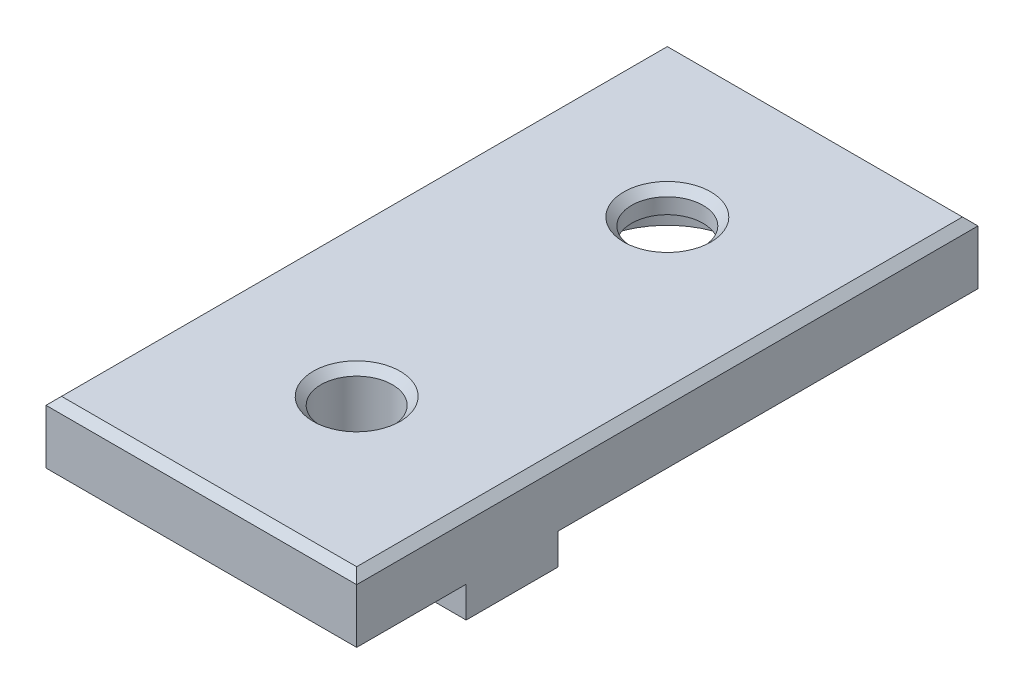
ISO-10303-21;
HEADER;
FILE_DESCRIPTION(('STEP AP214'),'2;1');
FILE_NAME('part.step','',(''),(''),'','','');
FILE_SCHEMA(('AUTOMOTIVE_DESIGN { 1 0 10303 214 1 1 1 1 }'));
ENDSEC;
DATA;
#1=APPLICATION_CONTEXT('core data for automotive mechanical design processes');
#2=APPLICATION_PROTOCOL_DEFINITION('international standard','automotive_design',2000,#1);
#3=PRODUCT_CONTEXT('',#1,'mechanical');
#4=PRODUCT('Part','Part','',(#3));
#5=PRODUCT_RELATED_PRODUCT_CATEGORY('part','',(#4));
#6=PRODUCT_DEFINITION_FORMATION('','',#4);
#7=PRODUCT_DEFINITION_CONTEXT('part definition',#1,'design');
#8=PRODUCT_DEFINITION('design','',#6,#7);
#9=PRODUCT_DEFINITION_SHAPE('','',#8);
#10=(LENGTH_UNIT() NAMED_UNIT(*) SI_UNIT(.MILLI.,.METRE.));
#11=(NAMED_UNIT(*) PLANE_ANGLE_UNIT() SI_UNIT($,.RADIAN.));
#12=(NAMED_UNIT(*) SI_UNIT($,.STERADIAN.) SOLID_ANGLE_UNIT());
#13=UNCERTAINTY_MEASURE_WITH_UNIT(LENGTH_MEASURE(1.E-05),#10,'distance_accuracy_value','');
#14=(GEOMETRIC_REPRESENTATION_CONTEXT(3) GLOBAL_UNCERTAINTY_ASSIGNED_CONTEXT((#13)) GLOBAL_UNIT_ASSIGNED_CONTEXT((#10,
#11,#12)) REPRESENTATION_CONTEXT('',''));
#15=CARTESIAN_POINT('',(0.,0.,0.));
#16=DIRECTION('',(0.,0.,1.));
#17=DIRECTION('',(1.,0.,0.));
#18=AXIS2_PLACEMENT_3D('',#15,#16,#17);
#19=CARTESIAN_POINT('',(0.,0.,-10.));
#20=DIRECTION('',(0.,1.,0.));
#21=DIRECTION('',(0.,0.,1.));
#22=AXIS2_PLACEMENT_3D('',#19,#20,#21);
#23=CYLINDRICAL_SURFACE('',#22,2.3);
#24=CARTESIAN_POINT('',(0.,3.5,-10.));
#25=DIRECTION('',(0.,1.,0.));
#26=DIRECTION('',(0.,0.,1.));
#27=AXIS2_PLACEMENT_3D('',#24,#25,#26);
#28=CIRCLE('',#27,2.3);
#29=CARTESIAN_POINT('',(0.,3.5,-7.7));
#30=VERTEX_POINT('',#29);
#31=EDGE_CURVE('E44',#30,#30,#28,.T.);
#32=ORIENTED_EDGE('',*,*,#31,.T.);
#33=EDGE_LOOP('',(#32));
#34=FACE_BOUND('',#33,.T.);
#35=CARTESIAN_POINT('',(0.,2.5,-10.));
#36=DIRECTION('',(0.,-1.,0.));
#37=DIRECTION('',(0.,0.,-1.));
#38=AXIS2_PLACEMENT_3D('',#35,#36,#37);
#39=CIRCLE('',#38,2.3);
#40=CARTESIAN_POINT('',(0.,2.5,-12.3));
#41=VERTEX_POINT('',#40);
#42=EDGE_CURVE('E39',#41,#41,#39,.F.);
#43=ORIENTED_EDGE('',*,*,#42,.F.);
#44=EDGE_LOOP('',(#43));
#45=FACE_BOUND('',#44,.T.);
#46=ADVANCED_FACE('F35',(#34,#45),#23,.F.);
#47=CARTESIAN_POINT('',(10.,4.,-20.));
#48=DIRECTION('',(-1.,0.,0.));
#49=DIRECTION('',(0.,0.,1.));
#50=AXIS2_PLACEMENT_3D('',#47,#48,#49);
#51=PLANE('',#50);
#52=DIRECTION('',(0.,-1.,0.));
#53=VECTOR('',#52,1.);
#54=CARTESIAN_POINT('',(10.,4.,-20.));
#55=LINE('',#54,#53);
#56=CARTESIAN_POINT('',(10.,3.50000000000001,-20.));
#57=VERTEX_POINT('',#56);
#58=CARTESIAN_POINT('',(10.,0.,-20.));
#59=VERTEX_POINT('',#58);
#60=EDGE_CURVE('E234',#57,#59,#55,.T.);
#61=ORIENTED_EDGE('',*,*,#60,.F.);
#62=DIRECTION('',(0.,0.,1.));
#63=VECTOR('',#62,1.);
#64=CARTESIAN_POINT('',(10.,3.50000000000001,20.));
#65=LINE('',#64,#63);
#66=CARTESIAN_POINT('',(10.,3.50000000000001,20.));
#67=VERTEX_POINT('',#66);
#68=EDGE_CURVE('E256',#57,#67,#65,.T.);
#69=ORIENTED_EDGE('',*,*,#68,.T.);
#70=DIRECTION('',(0.,-1.,0.));
#71=VECTOR('',#70,1.);
#72=CARTESIAN_POINT('',(10.,4.,20.));
#73=LINE('',#72,#71);
#74=CARTESIAN_POINT('',(10.,0.,20.));
#75=VERTEX_POINT('',#74);
#76=EDGE_CURVE('E228',#67,#75,#73,.T.);
#77=ORIENTED_EDGE('',*,*,#76,.T.);
#78=DIRECTION('',(0.,0.,-1.));
#79=VECTOR('',#78,1.);
#80=CARTESIAN_POINT('',(10.,0.,-20.));
#81=LINE('',#80,#79);
#82=CARTESIAN_POINT('',(10.,0.,12.95));
#83=VERTEX_POINT('',#82);
#84=EDGE_CURVE('E215',#75,#83,#81,.T.);
#85=ORIENTED_EDGE('',*,*,#84,.T.);
#86=DIRECTION('',(0.,1.,0.));
#87=VECTOR('',#86,1.);
#88=CARTESIAN_POINT('',(10.,-2.,12.95));
#89=LINE('',#88,#87);
#90=CARTESIAN_POINT('',(10.,-2.,12.95));
#91=VERTEX_POINT('',#90);
#92=EDGE_CURVE('E202',#91,#83,#89,.T.);
#93=ORIENTED_EDGE('',*,*,#92,.F.);
#94=DIRECTION('',(0.,0.,1.));
#95=VECTOR('',#94,1.);
#96=CARTESIAN_POINT('',(10.,-2.,0.));
#97=LINE('',#96,#95);
#98=CARTESIAN_POINT('',(10.,-2.,7.05));
#99=VERTEX_POINT('',#98);
#100=EDGE_CURVE('E188',#99,#91,#97,.T.);
#101=ORIENTED_EDGE('',*,*,#100,.F.);
#102=DIRECTION('',(0.,1.,0.));
#103=VECTOR('',#102,1.);
#104=CARTESIAN_POINT('',(10.,-2.,7.05));
#105=LINE('',#104,#103);
#106=CARTESIAN_POINT('',(10.,0.,7.05));
#107=VERTEX_POINT('',#106);
#108=EDGE_CURVE('E205',#99,#107,#105,.T.);
#109=ORIENTED_EDGE('',*,*,#108,.T.);
#110=EDGE_CURVE('E214',#107,#59,#81,.T.);
#111=ORIENTED_EDGE('',*,*,#110,.T.);
#112=EDGE_LOOP('',(#61,#69,#77,#85,#93,#101,#109,#111));
#113=FACE_BOUND('',#112,.T.);
#114=ADVANCED_FACE('F283',(#113),#51,.F.);
#115=CARTESIAN_POINT('',(-10.,4.,-20.));
#116=DIRECTION('',(0.,0.,1.));
#117=DIRECTION('',(1.,0.,0.));
#118=AXIS2_PLACEMENT_3D('',#115,#116,#117);
#119=PLANE('',#118);
#120=DIRECTION('',(0.,-1.,0.));
#121=VECTOR('',#120,1.);
#122=CARTESIAN_POINT('',(-10.,4.,-20.));
#123=LINE('',#122,#121);
#124=CARTESIAN_POINT('',(-10.,3.50000000000001,-20.));
#125=VERTEX_POINT('',#124);
#126=CARTESIAN_POINT('',(-10.,0.,-20.));
#127=VERTEX_POINT('',#126);
#128=EDGE_CURVE('E232',#125,#127,#123,.T.);
#129=ORIENTED_EDGE('',*,*,#128,.F.);
#130=DIRECTION('',(1.,0.,0.));
#131=VECTOR('',#130,1.);
#132=CARTESIAN_POINT('',(10.,3.50000000000001,-20.));
#133=LINE('',#132,#131);
#134=EDGE_CURVE('E52',#125,#57,#133,.T.);
#135=ORIENTED_EDGE('',*,*,#134,.T.);
#136=ORIENTED_EDGE('',*,*,#60,.T.);
#137=DIRECTION('',(-1.,0.,0.));
#138=VECTOR('',#137,1.);
#139=CARTESIAN_POINT('',(-10.,0.,-20.));
#140=LINE('',#139,#138);
#141=EDGE_CURVE('E218',#59,#127,#140,.T.);
#142=ORIENTED_EDGE('',*,*,#141,.T.);
#143=EDGE_LOOP('',(#129,#135,#136,#142));
#144=FACE_BOUND('',#143,.T.);
#145=ADVANCED_FACE('F327',(#144),#119,.F.);
#146=CARTESIAN_POINT('',(-10.,4.,-20.));
#147=DIRECTION('',(1.,0.,0.));
#148=DIRECTION('',(0.,0.,-1.));
#149=AXIS2_PLACEMENT_3D('',#146,#147,#148);
#150=PLANE('',#149);
#151=DIRECTION('',(0.,-1.,0.));
#152=VECTOR('',#151,1.);
#153=CARTESIAN_POINT('',(-10.,4.,20.));
#154=LINE('',#153,#152);
#155=CARTESIAN_POINT('',(-10.,3.50000000000001,20.));
#156=VERTEX_POINT('',#155);
#157=CARTESIAN_POINT('',(-10.,0.,20.));
#158=VERTEX_POINT('',#157);
#159=EDGE_CURVE('E230',#156,#158,#154,.T.);
#160=ORIENTED_EDGE('',*,*,#159,.F.);
#161=DIRECTION('',(0.,0.,-1.));
#162=VECTOR('',#161,1.);
#163=CARTESIAN_POINT('',(-10.,3.50000000000001,-20.));
#164=LINE('',#163,#162);
#165=EDGE_CURVE('E60',#156,#125,#164,.T.);
#166=ORIENTED_EDGE('',*,*,#165,.T.);
#167=ORIENTED_EDGE('',*,*,#128,.T.);
#168=DIRECTION('',(0.,0.,1.));
#169=VECTOR('',#168,1.);
#170=CARTESIAN_POINT('',(-10.,0.,-20.));
#171=LINE('',#170,#169);
#172=CARTESIAN_POINT('',(-10.,0.,7.05));
#173=VERTEX_POINT('',#172);
#174=EDGE_CURVE('E222',#127,#173,#171,.T.);
#175=ORIENTED_EDGE('',*,*,#174,.T.);
#176=DIRECTION('',(0.,1.,0.));
#177=VECTOR('',#176,1.);
#178=CARTESIAN_POINT('',(-10.,-2.,7.05));
#179=LINE('',#178,#177);
#180=CARTESIAN_POINT('',(-10.,-2.,7.05));
#181=VERTEX_POINT('',#180);
#182=EDGE_CURVE('E178',#181,#173,#179,.T.);
#183=ORIENTED_EDGE('',*,*,#182,.F.);
#184=DIRECTION('',(0.,0.,-1.));
#185=VECTOR('',#184,1.);
#186=CARTESIAN_POINT('',(-10.,-2.,0.));
#187=LINE('',#186,#185);
#188=CARTESIAN_POINT('',(-10.,-2.,12.95));
#189=VERTEX_POINT('',#188);
#190=EDGE_CURVE('E164',#189,#181,#187,.T.);
#191=ORIENTED_EDGE('',*,*,#190,.F.);
#192=DIRECTION('',(0.,1.,0.));
#193=VECTOR('',#192,1.);
#194=CARTESIAN_POINT('',(-10.,-2.,12.95));
#195=LINE('',#194,#193);
#196=CARTESIAN_POINT('',(-10.,0.,12.95));
#197=VERTEX_POINT('',#196);
#198=EDGE_CURVE('E150',#189,#197,#195,.T.);
#199=ORIENTED_EDGE('',*,*,#198,.T.);
#200=EDGE_CURVE('E221',#197,#158,#171,.T.);
#201=ORIENTED_EDGE('',*,*,#200,.T.);
#202=EDGE_LOOP('',(#160,#166,#167,#175,#183,#191,#199,#201));
#203=FACE_BOUND('',#202,.T.);
#204=ADVANCED_FACE('F321',(#203),#150,.F.);
#205=CARTESIAN_POINT('',(-10.,4.,20.));
#206=DIRECTION('',(0.,0.,-1.));
#207=DIRECTION('',(-1.,0.,0.));
#208=AXIS2_PLACEMENT_3D('',#205,#206,#207);
#209=PLANE('',#208);
#210=ORIENTED_EDGE('',*,*,#76,.F.);
#211=DIRECTION('',(-1.,0.,0.));
#212=VECTOR('',#211,1.);
#213=CARTESIAN_POINT('',(-10.,3.50000000000001,20.));
#214=LINE('',#213,#212);
#215=EDGE_CURVE('E251',#67,#156,#214,.T.);
#216=ORIENTED_EDGE('',*,*,#215,.T.);
#217=ORIENTED_EDGE('',*,*,#159,.T.);
#218=DIRECTION('',(1.,0.,0.));
#219=VECTOR('',#218,1.);
#220=CARTESIAN_POINT('',(-10.,0.,20.));
#221=LINE('',#220,#219);
#222=EDGE_CURVE('E225',#158,#75,#221,.T.);
#223=ORIENTED_EDGE('',*,*,#222,.T.);
#224=EDGE_LOOP('',(#210,#216,#217,#223));
#225=FACE_BOUND('',#224,.T.);
#226=ADVANCED_FACE('F287',(#225),#209,.F.);
#227=CARTESIAN_POINT('',(0.,4.,0.));
#228=DIRECTION('',(0.,1.,0.));
#229=DIRECTION('',(0.,0.,1.));
#230=AXIS2_PLACEMENT_3D('',#227,#228,#229);
#231=PLANE('',#230);
#232=DIRECTION('',(0.,0.,1.));
#233=VECTOR('',#232,1.);
#234=CARTESIAN_POINT('',(-9.5,4.,20.));
#235=LINE('',#234,#233);
#236=CARTESIAN_POINT('',(-9.50000000000001,4.,-19.5));
#237=VERTEX_POINT('',#236);
#238=CARTESIAN_POINT('',(-9.5,4.,19.5));
#239=VERTEX_POINT('',#238);
#240=EDGE_CURVE('E246',#237,#239,#235,.T.);
#241=ORIENTED_EDGE('',*,*,#240,.T.);
#242=DIRECTION('',(1.,0.,0.));
#243=VECTOR('',#242,1.);
#244=CARTESIAN_POINT('',(10.,4.,19.5));
#245=LINE('',#244,#243);
#246=CARTESIAN_POINT('',(9.50000000000001,4.,19.5));
#247=VERTEX_POINT('',#246);
#248=EDGE_CURVE('E248',#239,#247,#245,.T.);
#249=ORIENTED_EDGE('',*,*,#248,.T.);
#250=DIRECTION('',(0.,0.,-1.));
#251=VECTOR('',#250,1.);
#252=CARTESIAN_POINT('',(9.50000000000001,4.,-20.));
#253=LINE('',#252,#251);
#254=CARTESIAN_POINT('',(9.50000000000001,4.,-19.5));
#255=VERTEX_POINT('',#254);
#256=EDGE_CURVE('E242',#247,#255,#253,.T.);
#257=ORIENTED_EDGE('',*,*,#256,.T.);
#258=DIRECTION('',(-1.,0.,0.));
#259=VECTOR('',#258,1.);
#260=CARTESIAN_POINT('',(-10.,4.,-19.5));
#261=LINE('',#260,#259);
#262=EDGE_CURVE('E244',#255,#237,#261,.T.);
#263=ORIENTED_EDGE('',*,*,#262,.T.);
#264=EDGE_LOOP('',(#241,#249,#257,#263));
#265=FACE_BOUND('',#264,.T.);
#266=CARTESIAN_POINT('',(0.,4.,-10.));
#267=DIRECTION('',(0.,1.,0.));
#268=DIRECTION('',(0.,0.,1.));
#269=AXIS2_PLACEMENT_3D('',#266,#267,#268);
#270=CIRCLE('',#269,2.8);
#271=CARTESIAN_POINT('',(0.,4.,-7.20000000000001));
#272=VERTEX_POINT('',#271);
#273=EDGE_CURVE('E239',#272,#272,#270,.F.);
#274=ORIENTED_EDGE('',*,*,#273,.T.);
#275=EDGE_LOOP('',(#274));
#276=FACE_BOUND('',#275,.T.);
#277=CARTESIAN_POINT('',(0.,4.,10.));
#278=DIRECTION('',(0.,1.,0.));
#279=DIRECTION('',(0.,0.,1.));
#280=AXIS2_PLACEMENT_3D('',#277,#278,#279);
#281=CIRCLE('',#280,2.79999999999999);
#282=CARTESIAN_POINT('',(0.,4.,12.8));
#283=VERTEX_POINT('',#282);
#284=EDGE_CURVE('E236',#283,#283,#281,.F.);
#285=ORIENTED_EDGE('',*,*,#284,.T.);
#286=EDGE_LOOP('',(#285));
#287=FACE_BOUND('',#286,.T.);
#288=ADVANCED_FACE('F294',(#265,#276,#287),#231,.T.);
#289=CARTESIAN_POINT('',(0.,0.,0.));
#290=DIRECTION('',(0.,1.,0.));
#291=DIRECTION('',(0.,0.,1.));
#292=AXIS2_PLACEMENT_3D('',#289,#290,#291);
#293=PLANE('',#292);
#294=CARTESIAN_POINT('',(0.,0.,-10.));
#295=DIRECTION('',(0.,-1.,0.));
#296=DIRECTION('',(0.,0.,-1.));
#297=AXIS2_PLACEMENT_3D('',#294,#295,#296);
#298=CIRCLE('',#297,5.);
#299=CARTESIAN_POINT('',(0.,0.,-15.));
#300=VERTEX_POINT('',#299);
#301=EDGE_CURVE('E553',#300,#300,#298,.T.);
#302=ORIENTED_EDGE('',*,*,#301,.F.);
#303=EDGE_LOOP('',(#302));
#304=FACE_BOUND('',#303,.T.);
#305=CARTESIAN_POINT('',(0.,0.,10.));
#306=DIRECTION('',(0.,1.,0.));
#307=DIRECTION('',(0.,0.,1.));
#308=AXIS2_PLACEMENT_3D('',#305,#306,#307);
#309=CIRCLE('',#308,2.3);
#310=CARTESIAN_POINT('',(0.,0.,12.3));
#311=VERTEX_POINT('',#310);
#312=EDGE_CURVE('E211',#311,#311,#309,.T.);
#313=ORIENTED_EDGE('',*,*,#312,.T.);
#314=EDGE_LOOP('',(#313));
#315=FACE_BOUND('',#314,.T.);
#316=ORIENTED_EDGE('',*,*,#200,.F.);
#317=DIRECTION('',(1.,0.,0.));
#318=VECTOR('',#317,1.);
#319=CARTESIAN_POINT('',(0.,0.,12.95));
#320=LINE('',#319,#318);
#321=CARTESIAN_POINT('',(-3.,0.,12.95));
#322=VERTEX_POINT('',#321);
#323=EDGE_CURVE('E172',#197,#322,#320,.T.);
#324=ORIENTED_EDGE('',*,*,#323,.T.);
#325=DIRECTION('',(0.,0.,-1.));
#326=VECTOR('',#325,1.);
#327=CARTESIAN_POINT('',(-3.,0.,0.));
#328=LINE('',#327,#326);
#329=CARTESIAN_POINT('',(-3.,0.,7.05));
#330=VERTEX_POINT('',#329);
#331=EDGE_CURVE('E145',#322,#330,#328,.T.);
#332=ORIENTED_EDGE('',*,*,#331,.T.);
#333=DIRECTION('',(1.,0.,0.));
#334=VECTOR('',#333,1.);
#335=CARTESIAN_POINT('',(0.,0.,7.05));
#336=LINE('',#335,#334);
#337=EDGE_CURVE('E159',#173,#330,#336,.T.);
#338=ORIENTED_EDGE('',*,*,#337,.F.);
#339=ORIENTED_EDGE('',*,*,#174,.F.);
#340=ORIENTED_EDGE('',*,*,#141,.F.);
#341=ORIENTED_EDGE('',*,*,#110,.F.);
#342=DIRECTION('',(1.,0.,0.));
#343=VECTOR('',#342,1.);
#344=CARTESIAN_POINT('',(0.,0.,7.05));
#345=LINE('',#344,#343);
#346=CARTESIAN_POINT('',(3.,0.,7.05));
#347=VERTEX_POINT('',#346);
#348=EDGE_CURVE('E196',#347,#107,#345,.T.);
#349=ORIENTED_EDGE('',*,*,#348,.F.);
#350=DIRECTION('',(0.,0.,-1.));
#351=VECTOR('',#350,1.);
#352=CARTESIAN_POINT('',(3.,0.,0.));
#353=LINE('',#352,#351);
#354=CARTESIAN_POINT('',(3.,0.,12.95));
#355=VERTEX_POINT('',#354);
#356=EDGE_CURVE('E149',#355,#347,#353,.T.);
#357=ORIENTED_EDGE('',*,*,#356,.F.);
#358=DIRECTION('',(1.,0.,0.));
#359=VECTOR('',#358,1.);
#360=CARTESIAN_POINT('',(0.,0.,12.95));
#361=LINE('',#360,#359);
#362=EDGE_CURVE('E186',#355,#83,#361,.T.);
#363=ORIENTED_EDGE('',*,*,#362,.T.);
#364=ORIENTED_EDGE('',*,*,#84,.F.);
#365=ORIENTED_EDGE('',*,*,#222,.F.);
#366=EDGE_LOOP('',(#316,#324,#332,#338,#339,#340,#341,#349,#357,#363,#364,#365));
#367=FACE_BOUND('',#366,.T.);
#368=ADVANCED_FACE('F297',(#304,#315,#367),#293,.F.);
#369=CARTESIAN_POINT('',(0.,0.,10.));
#370=DIRECTION('',(0.,1.,0.));
#371=DIRECTION('',(0.,0.,1.));
#372=AXIS2_PLACEMENT_3D('',#369,#370,#371);
#373=CYLINDRICAL_SURFACE('',#372,2.3);
#374=CARTESIAN_POINT('',(0.,3.50000000000001,10.));
#375=DIRECTION('',(0.,1.,0.));
#376=DIRECTION('',(0.,0.,1.));
#377=AXIS2_PLACEMENT_3D('',#374,#375,#376);
#378=CIRCLE('',#377,2.3);
#379=CARTESIAN_POINT('',(0.,3.50000000000001,12.3));
#380=VERTEX_POINT('',#379);
#381=EDGE_CURVE('E11',#380,#380,#378,.T.);
#382=ORIENTED_EDGE('',*,*,#381,.T.);
#383=EDGE_LOOP('',(#382));
#384=FACE_BOUND('',#383,.T.);
#385=ORIENTED_EDGE('',*,*,#312,.F.);
#386=EDGE_LOOP('',(#385));
#387=FACE_BOUND('',#386,.T.);
#388=ADVANCED_FACE('F309',(#384,#387),#373,.F.);
#389=CARTESIAN_POINT('',(3.,-2.,0.));
#390=DIRECTION('',(1.,0.,0.));
#391=DIRECTION('',(0.,0.,-1.));
#392=AXIS2_PLACEMENT_3D('',#389,#390,#391);
#393=PLANE('',#392);
#394=ORIENTED_EDGE('',*,*,#356,.T.);
#395=DIRECTION('',(0.,1.,0.));
#396=VECTOR('',#395,1.);
#397=CARTESIAN_POINT('',(3.,-2.,7.05));
#398=LINE('',#397,#396);
#399=CARTESIAN_POINT('',(3.,-2.,7.05));
#400=VERTEX_POINT('',#399);
#401=EDGE_CURVE('E208',#400,#347,#398,.T.);
#402=ORIENTED_EDGE('',*,*,#401,.F.);
#403=DIRECTION('',(0.,0.,-1.));
#404=VECTOR('',#403,1.);
#405=CARTESIAN_POINT('',(3.,-2.,0.));
#406=LINE('',#405,#404);
#407=CARTESIAN_POINT('',(3.,-2.,12.95));
#408=VERTEX_POINT('',#407);
#409=EDGE_CURVE('E182',#408,#400,#406,.T.);
#410=ORIENTED_EDGE('',*,*,#409,.F.);
#411=DIRECTION('',(0.,1.,0.));
#412=VECTOR('',#411,1.);
#413=CARTESIAN_POINT('',(3.,-2.,12.95));
#414=LINE('',#413,#412);
#415=EDGE_CURVE('E193',#408,#355,#414,.T.);
#416=ORIENTED_EDGE('',*,*,#415,.T.);
#417=EDGE_LOOP('',(#394,#402,#410,#416));
#418=FACE_BOUND('',#417,.T.);
#419=ADVANCED_FACE('F312',(#418),#393,.F.);
#420=CARTESIAN_POINT('',(0.,-2.,7.05));
#421=DIRECTION('',(0.,0.,1.));
#422=DIRECTION('',(1.,0.,0.));
#423=AXIS2_PLACEMENT_3D('',#420,#421,#422);
#424=PLANE('',#423);
#425=ORIENTED_EDGE('',*,*,#348,.T.);
#426=ORIENTED_EDGE('',*,*,#108,.F.);
#427=DIRECTION('',(1.,0.,0.));
#428=VECTOR('',#427,1.);
#429=CARTESIAN_POINT('',(0.,-2.,7.05));
#430=LINE('',#429,#428);
#431=EDGE_CURVE('E185',#400,#99,#430,.T.);
#432=ORIENTED_EDGE('',*,*,#431,.F.);
#433=ORIENTED_EDGE('',*,*,#401,.T.);
#434=EDGE_LOOP('',(#425,#426,#432,#433));
#435=FACE_BOUND('',#434,.T.);
#436=ADVANCED_FACE('F332',(#435),#424,.F.);
#437=CARTESIAN_POINT('',(0.,-2.,12.95));
#438=DIRECTION('',(0.,0.,1.));
#439=DIRECTION('',(1.,0.,0.));
#440=AXIS2_PLACEMENT_3D('',#437,#438,#439);
#441=PLANE('',#440);
#442=ORIENTED_EDGE('',*,*,#362,.F.);
#443=ORIENTED_EDGE('',*,*,#415,.F.);
#444=DIRECTION('',(1.,0.,0.));
#445=VECTOR('',#444,1.);
#446=CARTESIAN_POINT('',(0.,-2.,12.95));
#447=LINE('',#446,#445);
#448=EDGE_CURVE('E190',#408,#91,#447,.T.);
#449=ORIENTED_EDGE('',*,*,#448,.T.);
#450=ORIENTED_EDGE('',*,*,#92,.T.);
#451=EDGE_LOOP('',(#442,#443,#449,#450));
#452=FACE_BOUND('',#451,.T.);
#453=ADVANCED_FACE('F339',(#452),#441,.T.);
#454=CARTESIAN_POINT('',(0.,-2.,0.));
#455=DIRECTION('',(0.,-1.,0.));
#456=DIRECTION('',(0.,0.,-1.));
#457=AXIS2_PLACEMENT_3D('',#454,#455,#456);
#458=PLANE('',#457);
#459=ORIENTED_EDGE('',*,*,#409,.T.);
#460=ORIENTED_EDGE('',*,*,#431,.T.);
#461=ORIENTED_EDGE('',*,*,#100,.T.);
#462=ORIENTED_EDGE('',*,*,#448,.F.);
#463=EDGE_LOOP('',(#459,#460,#461,#462));
#464=FACE_BOUND('',#463,.T.);
#465=ADVANCED_FACE('F341',(#464),#458,.T.);
#466=CARTESIAN_POINT('',(-3.,-2.,0.));
#467=DIRECTION('',(1.,0.,0.));
#468=DIRECTION('',(0.,0.,-1.));
#469=AXIS2_PLACEMENT_3D('',#466,#467,#468);
#470=PLANE('',#469);
#471=ORIENTED_EDGE('',*,*,#331,.F.);
#472=DIRECTION('',(0.,1.,0.));
#473=VECTOR('',#472,1.);
#474=CARTESIAN_POINT('',(-3.,-2.,12.95));
#475=LINE('',#474,#473);
#476=CARTESIAN_POINT('',(-3.,-2.,12.95));
#477=VERTEX_POINT('',#476);
#478=EDGE_CURVE('E140',#477,#322,#475,.T.);
#479=ORIENTED_EDGE('',*,*,#478,.F.);
#480=DIRECTION('',(0.,0.,-1.));
#481=VECTOR('',#480,1.);
#482=CARTESIAN_POINT('',(-3.,-2.,0.));
#483=LINE('',#482,#481);
#484=CARTESIAN_POINT('',(-3.,-2.,7.05));
#485=VERTEX_POINT('',#484);
#486=EDGE_CURVE('E144',#477,#485,#483,.T.);
#487=ORIENTED_EDGE('',*,*,#486,.T.);
#488=DIRECTION('',(0.,1.,0.));
#489=VECTOR('',#488,1.);
#490=CARTESIAN_POINT('',(-3.,-2.,7.05));
#491=LINE('',#490,#489);
#492=EDGE_CURVE('E170',#485,#330,#491,.T.);
#493=ORIENTED_EDGE('',*,*,#492,.T.);
#494=EDGE_LOOP('',(#471,#479,#487,#493));
#495=FACE_BOUND('',#494,.T.);
#496=ADVANCED_FACE('F142',(#495),#470,.T.);
#497=CARTESIAN_POINT('',(0.,-2.,12.95));
#498=DIRECTION('',(0.,0.,1.));
#499=DIRECTION('',(1.,0.,0.));
#500=AXIS2_PLACEMENT_3D('',#497,#498,#499);
#501=PLANE('',#500);
#502=ORIENTED_EDGE('',*,*,#323,.F.);
#503=ORIENTED_EDGE('',*,*,#198,.F.);
#504=DIRECTION('',(1.,0.,0.));
#505=VECTOR('',#504,1.);
#506=CARTESIAN_POINT('',(0.,-2.,12.95));
#507=LINE('',#506,#505);
#508=EDGE_CURVE('E155',#189,#477,#507,.T.);
#509=ORIENTED_EDGE('',*,*,#508,.T.);
#510=ORIENTED_EDGE('',*,*,#478,.T.);
#511=EDGE_LOOP('',(#502,#503,#509,#510));
#512=FACE_BOUND('',#511,.T.);
#513=ADVANCED_FACE('F161',(#512),#501,.T.);
#514=CARTESIAN_POINT('',(0.,-2.,7.05));
#515=DIRECTION('',(0.,0.,1.));
#516=DIRECTION('',(1.,0.,0.));
#517=AXIS2_PLACEMENT_3D('',#514,#515,#516);
#518=PLANE('',#517);
#519=ORIENTED_EDGE('',*,*,#337,.T.);
#520=ORIENTED_EDGE('',*,*,#492,.F.);
#521=DIRECTION('',(1.,0.,0.));
#522=VECTOR('',#521,1.);
#523=CARTESIAN_POINT('',(0.,-2.,7.05));
#524=LINE('',#523,#522);
#525=EDGE_CURVE('E157',#181,#485,#524,.T.);
#526=ORIENTED_EDGE('',*,*,#525,.F.);
#527=ORIENTED_EDGE('',*,*,#182,.T.);
#528=EDGE_LOOP('',(#519,#520,#526,#527));
#529=FACE_BOUND('',#528,.T.);
#530=ADVANCED_FACE('F325',(#529),#518,.F.);
#531=CARTESIAN_POINT('',(0.,-2.,0.));
#532=DIRECTION('',(0.,-1.,0.));
#533=DIRECTION('',(0.,0.,-1.));
#534=AXIS2_PLACEMENT_3D('',#531,#532,#533);
#535=PLANE('',#534);
#536=ORIENTED_EDGE('',*,*,#486,.F.);
#537=ORIENTED_EDGE('',*,*,#508,.F.);
#538=ORIENTED_EDGE('',*,*,#190,.T.);
#539=ORIENTED_EDGE('',*,*,#525,.T.);
#540=EDGE_LOOP('',(#536,#537,#538,#539));
#541=FACE_BOUND('',#540,.T.);
#542=ADVANCED_FACE('F154',(#541),#535,.T.);
#543=CARTESIAN_POINT('',(0.,4.,-19.5));
#544=DIRECTION('',(0.,0.707106781186547,-0.707106781186547));
#545=DIRECTION('',(1.,0.,0.));
#546=AXIS2_PLACEMENT_3D('',#543,#544,#545);
#547=PLANE('',#546);
#548=DIRECTION('',(-0.577350269189625,0.577350269189626,0.577350269189626));
#549=VECTOR('',#548,1.);
#550=CARTESIAN_POINT('',(3.00000000000001,10.5,-13.));
#551=LINE('',#550,#549);
#552=EDGE_CURVE('E264',#57,#255,#551,.T.);
#553=ORIENTED_EDGE('',*,*,#552,.F.);
#554=ORIENTED_EDGE('',*,*,#134,.F.);
#555=DIRECTION('',(0.577350269189627,0.577350269189625,0.577350269189625));
#556=VECTOR('',#555,1.);
#557=CARTESIAN_POINT('',(-6.33333333333333,7.16666666666667,-16.3333333333333));
#558=LINE('',#557,#556);
#559=EDGE_CURVE('E173',#237,#125,#558,.F.);
#560=ORIENTED_EDGE('',*,*,#559,.F.);
#561=ORIENTED_EDGE('',*,*,#262,.F.);
#562=EDGE_LOOP('',(#553,#554,#560,#561));
#563=FACE_BOUND('',#562,.T.);
#564=ADVANCED_FACE('F275',(#563),#547,.T.);
#565=CARTESIAN_POINT('',(-9.50000000000001,4.,0.));
#566=DIRECTION('',(-0.707106781186547,0.707106781186548,0.));
#567=DIRECTION('',(0.,0.,-1.));
#568=AXIS2_PLACEMENT_3D('',#565,#566,#567);
#569=PLANE('',#568);
#570=ORIENTED_EDGE('',*,*,#559,.T.);
#571=ORIENTED_EDGE('',*,*,#165,.F.);
#572=DIRECTION('',(0.577350269189626,0.577350269189626,-0.577350269189625));
#573=VECTOR('',#572,1.);
#574=CARTESIAN_POINT('',(-3.,10.5,13.));
#575=LINE('',#574,#573);
#576=EDGE_CURVE('E262',#239,#156,#575,.F.);
#577=ORIENTED_EDGE('',*,*,#576,.F.);
#578=ORIENTED_EDGE('',*,*,#240,.F.);
#579=EDGE_LOOP('',(#570,#571,#577,#578));
#580=FACE_BOUND('',#579,.T.);
#581=ADVANCED_FACE('F270',(#580),#569,.T.);
#582=CARTESIAN_POINT('',(9.50000000000001,4.,0.));
#583=DIRECTION('',(0.707106781186548,0.707106781186547,0.));
#584=DIRECTION('',(0.,0.,1.));
#585=AXIS2_PLACEMENT_3D('',#582,#583,#584);
#586=PLANE('',#585);
#587=ORIENTED_EDGE('',*,*,#552,.T.);
#588=ORIENTED_EDGE('',*,*,#256,.F.);
#589=DIRECTION('',(0.577350269189625,-0.577350269189626,0.577350269189626));
#590=VECTOR('',#589,1.);
#591=CARTESIAN_POINT('',(3.00000000000001,10.5,13.));
#592=LINE('',#591,#590);
#593=EDGE_CURVE('E260',#67,#247,#592,.F.);
#594=ORIENTED_EDGE('',*,*,#593,.F.);
#595=ORIENTED_EDGE('',*,*,#68,.F.);
#596=EDGE_LOOP('',(#587,#588,#594,#595));
#597=FACE_BOUND('',#596,.T.);
#598=ADVANCED_FACE('F280',(#597),#586,.T.);
#599=CARTESIAN_POINT('',(0.,4.,19.5));
#600=DIRECTION('',(0.,0.707106781186547,0.707106781186547));
#601=DIRECTION('',(-1.,0.,0.));
#602=AXIS2_PLACEMENT_3D('',#599,#600,#601);
#603=PLANE('',#602);
#604=ORIENTED_EDGE('',*,*,#576,.T.);
#605=ORIENTED_EDGE('',*,*,#215,.F.);
#606=ORIENTED_EDGE('',*,*,#593,.T.);
#607=ORIENTED_EDGE('',*,*,#248,.F.);
#608=EDGE_LOOP('',(#604,#605,#606,#607));
#609=FACE_BOUND('',#608,.T.);
#610=ADVANCED_FACE('F291',(#609),#603,.T.);
#611=CARTESIAN_POINT('',(0.,3.5,-10.));
#612=DIRECTION('',(0.,1.,0.));
#613=DIRECTION('',(0.,0.,1.));
#614=AXIS2_PLACEMENT_3D('',#611,#612,#613);
#615=CONICAL_SURFACE('',#614,2.3,0.785398163397447);
#616=ORIENTED_EDGE('',*,*,#273,.F.);
#617=EDGE_LOOP('',(#616));
#618=FACE_BOUND('',#617,.T.);
#619=ORIENTED_EDGE('',*,*,#31,.F.);
#620=EDGE_LOOP('',(#619));
#621=FACE_BOUND('',#620,.T.);
#622=ADVANCED_FACE('F306',(#618,#621),#615,.F.);
#623=CARTESIAN_POINT('',(0.,3.50000000000001,10.));
#624=DIRECTION('',(0.,1.,0.));
#625=DIRECTION('',(0.,0.,1.));
#626=AXIS2_PLACEMENT_3D('',#623,#624,#625);
#627=CONICAL_SURFACE('',#626,2.3,0.785398163397447);
#628=ORIENTED_EDGE('',*,*,#284,.F.);
#629=EDGE_LOOP('',(#628));
#630=FACE_BOUND('',#629,.T.);
#631=ORIENTED_EDGE('',*,*,#381,.F.);
#632=EDGE_LOOP('',(#631));
#633=FACE_BOUND('',#632,.T.);
#634=ADVANCED_FACE('F37',(#630,#633),#627,.F.);
#635=CARTESIAN_POINT('',(0.,2.5,-10.));
#636=DIRECTION('',(0.,-1.,0.));
#637=DIRECTION('',(0.,0.,-1.));
#638=AXIS2_PLACEMENT_3D('',#635,#636,#637);
#639=PLANE('',#638);
#640=CARTESIAN_POINT('',(0.,2.5,-10.));
#641=DIRECTION('',(0.,-1.,0.));
#642=DIRECTION('',(0.,0.,-1.));
#643=AXIS2_PLACEMENT_3D('',#640,#641,#642);
#644=CIRCLE('',#643,5.);
#645=CARTESIAN_POINT('',(0.,2.5,-15.));
#646=VERTEX_POINT('',#645);
#647=EDGE_CURVE('E550',#646,#646,#644,.T.);
#648=ORIENTED_EDGE('',*,*,#647,.T.);
#649=EDGE_LOOP('',(#648));
#650=FACE_BOUND('',#649,.T.);
#651=ORIENTED_EDGE('',*,*,#42,.T.);
#652=EDGE_LOOP('',(#651));
#653=FACE_BOUND('',#652,.T.);
#654=ADVANCED_FACE('F305',(#650,#653),#639,.T.);
#655=CARTESIAN_POINT('',(0.,2.5,-10.));
#656=DIRECTION('',(0.,-1.,0.));
#657=DIRECTION('',(0.,0.,-1.));
#658=AXIS2_PLACEMENT_3D('',#655,#656,#657);
#659=CYLINDRICAL_SURFACE('',#658,5.);
#660=ORIENTED_EDGE('',*,*,#647,.F.);
#661=EDGE_LOOP('',(#660));
#662=FACE_BOUND('',#661,.T.);
#663=ORIENTED_EDGE('',*,*,#301,.T.);
#664=EDGE_LOOP('',(#663));
#665=FACE_BOUND('',#664,.T.);
#666=ADVANCED_FACE('F396',(#662,#665),#659,.F.);
#667=CLOSED_SHELL('',(#46,#114,#145,#204,#226,#288,#368,#388,#419,#436,#453,#465,#496,#513,#530,
#542,#564,#581,#598,#610,#622,#634,#654,#666));
#668=MANIFOLD_SOLID_BREP('B2',#667);
#669=ADVANCED_BREP_SHAPE_REPRESENTATION('',(#18,#668),#14);
#670=SHAPE_DEFINITION_REPRESENTATION(#9,#669);
ENDSEC;
END-ISO-10303-21;
